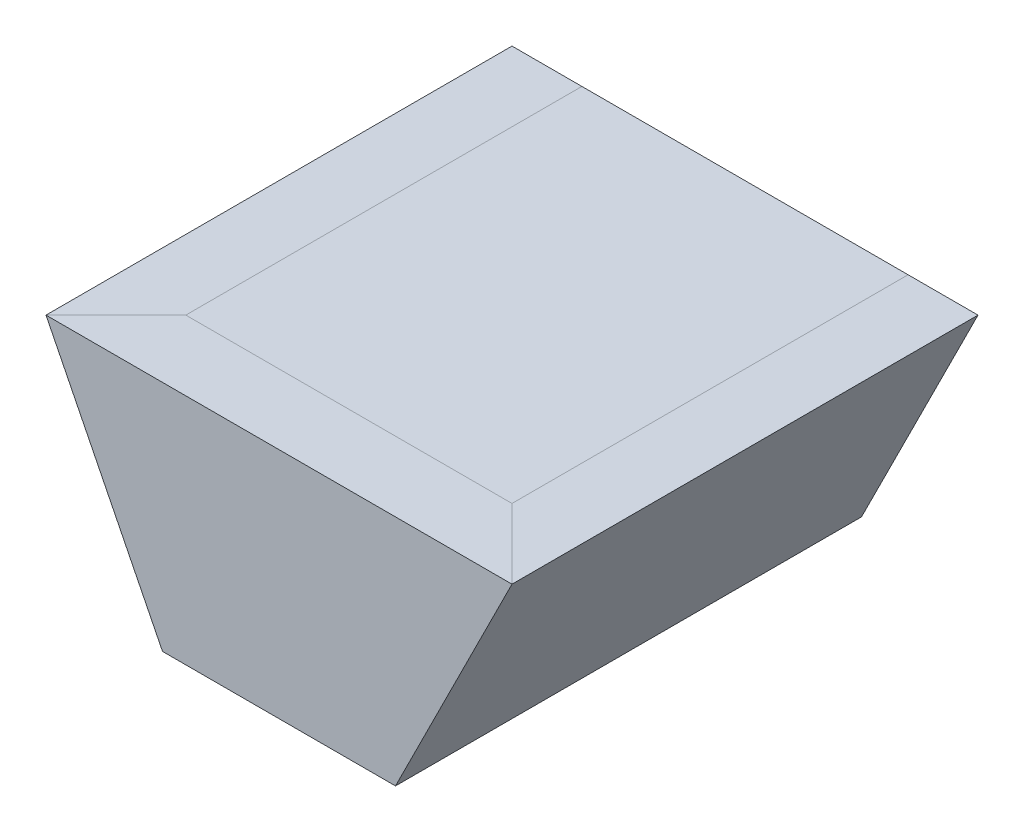
ISO-10303-21;
HEADER;
FILE_DESCRIPTION(('STEP AP214'),'2;1');
FILE_NAME('part.step','',(''),(''),'','','');
FILE_SCHEMA(('AUTOMOTIVE_DESIGN { 1 0 10303 214 1 1 1 1 }'));
ENDSEC;
DATA;
#1=APPLICATION_CONTEXT('core data for automotive mechanical design processes');
#2=APPLICATION_PROTOCOL_DEFINITION('international standard','automotive_design',2000,#1);
#3=PRODUCT_CONTEXT('',#1,'mechanical');
#4=PRODUCT('Part','Part','',(#3));
#5=PRODUCT_RELATED_PRODUCT_CATEGORY('part','',(#4));
#6=PRODUCT_DEFINITION_FORMATION('','',#4);
#7=PRODUCT_DEFINITION_CONTEXT('part definition',#1,'design');
#8=PRODUCT_DEFINITION('design','',#6,#7);
#9=PRODUCT_DEFINITION_SHAPE('','',#8);
#10=(LENGTH_UNIT() NAMED_UNIT(*) SI_UNIT(.MILLI.,.METRE.));
#11=(NAMED_UNIT(*) PLANE_ANGLE_UNIT() SI_UNIT($,.RADIAN.));
#12=(NAMED_UNIT(*) SI_UNIT($,.STERADIAN.) SOLID_ANGLE_UNIT());
#13=UNCERTAINTY_MEASURE_WITH_UNIT(LENGTH_MEASURE(1.E-05),#10,'distance_accuracy_value','');
#14=(GEOMETRIC_REPRESENTATION_CONTEXT(3) GLOBAL_UNCERTAINTY_ASSIGNED_CONTEXT((#13)) GLOBAL_UNIT_ASSIGNED_CONTEXT((#10,
#11,#12)) REPRESENTATION_CONTEXT('',''));
#15=CARTESIAN_POINT('',(0.,0.,0.));
#16=DIRECTION('',(0.,0.,1.));
#17=DIRECTION('',(1.,0.,0.));
#18=AXIS2_PLACEMENT_3D('',#15,#16,#17);
#19=CARTESIAN_POINT('',(0.,0.,-200.));
#20=DIRECTION('',(0.,0.,1.));
#21=DIRECTION('',(1.,0.,0.));
#22=AXIS2_PLACEMENT_3D('',#19,#20,#21);
#23=PLANE('',#22);
#24=DIRECTION('',(-0.707106781186548,-0.707106781186548,0.));
#25=VECTOR('',#24,1.);
#26=CARTESIAN_POINT('',(75.,-75.,-200.));
#27=LINE('',#26,#25);
#28=CARTESIAN_POINT('',(70.,-80.,-200.));
#29=VERTEX_POINT('',#28);
#30=CARTESIAN_POINT('',(50.,-100.,-200.));
#31=VERTEX_POINT('',#30);
#32=EDGE_CURVE('E11',#29,#31,#27,.T.);
#33=ORIENTED_EDGE('',*,*,#32,.F.);
#34=DIRECTION('',(1.,0.,0.));
#35=VECTOR('',#34,1.);
#36=CARTESIAN_POINT('',(0.,-80.,-200.));
#37=LINE('',#36,#35);
#38=CARTESIAN_POINT('',(130.,-80.,-200.));
#39=VERTEX_POINT('',#38);
#40=EDGE_CURVE('E158',#29,#39,#37,.T.);
#41=ORIENTED_EDGE('',*,*,#40,.T.);
#42=DIRECTION('',(0.707106781186547,-0.707106781186548,0.));
#43=VECTOR('',#42,1.);
#44=CARTESIAN_POINT('',(25.,25.,-200.));
#45=LINE('',#44,#43);
#46=CARTESIAN_POINT('',(150.,-100.,-200.));
#47=VERTEX_POINT('',#46);
#48=EDGE_CURVE('E44',#39,#47,#45,.T.);
#49=ORIENTED_EDGE('',*,*,#48,.T.);
#50=DIRECTION('',(1.,0.,0.));
#51=VECTOR('',#50,1.);
#52=CARTESIAN_POINT('',(50.,-100.,-200.));
#53=LINE('',#52,#51);
#54=EDGE_CURVE('E121',#31,#47,#53,.T.);
#55=ORIENTED_EDGE('',*,*,#54,.F.);
#56=EDGE_LOOP('',(#33,#41,#49,#55));
#57=FACE_BOUND('',#56,.T.);
#58=ADVANCED_FACE('F35',(#57),#23,.F.);
#59=ORIENTED_EDGE('',*,*,#48,.F.);
#60=DIRECTION('',(0.447213595499958,0.894427190999916,0.));
#61=VECTOR('',#60,1.);
#62=CARTESIAN_POINT('',(136.,-68.,-200.));
#63=LINE('',#62,#61);
#64=CARTESIAN_POINT('',(170.,0.,-200.));
#65=VERTEX_POINT('',#64);
#66=EDGE_CURVE('E161',#39,#65,#63,.T.);
#67=ORIENTED_EDGE('',*,*,#66,.T.);
#68=DIRECTION('',(-1.,0.,0.));
#69=VECTOR('',#68,1.);
#70=CARTESIAN_POINT('',(200.,0.,-200.));
#71=LINE('',#70,#69);
#72=CARTESIAN_POINT('',(200.,0.,-200.));
#73=VERTEX_POINT('',#72);
#74=EDGE_CURVE('E108',#73,#65,#71,.T.);
#75=ORIENTED_EDGE('',*,*,#74,.F.);
#76=DIRECTION('',(0.447213595499958,0.894427190999916,0.));
#77=VECTOR('',#76,1.);
#78=CARTESIAN_POINT('',(150.,-100.,-200.));
#79=LINE('',#78,#77);
#80=EDGE_CURVE('E117',#47,#73,#79,.T.);
#81=ORIENTED_EDGE('',*,*,#80,.F.);
#82=EDGE_LOOP('',(#59,#67,#75,#81));
#83=FACE_BOUND('',#82,.T.);
#84=ADVANCED_FACE('F177',(#83),#23,.F.);
#85=CARTESIAN_POINT('',(200.,0.,-200.));
#86=DIRECTION('',(0.,1.,0.));
#87=DIRECTION('',(0.,0.,1.));
#88=AXIS2_PLACEMENT_3D('',#85,#86,#87);
#89=PLANE('',#88);
#90=DIRECTION('',(0.,0.,-1.));
#91=VECTOR('',#90,1.);
#92=CARTESIAN_POINT('',(30.,0.,-200.));
#93=LINE('',#92,#91);
#94=CARTESIAN_POINT('',(30.,0.,-30.));
#95=VERTEX_POINT('',#94);
#96=CARTESIAN_POINT('',(30.,0.,-200.));
#97=VERTEX_POINT('',#96);
#98=EDGE_CURVE('E101',#95,#97,#93,.T.);
#99=ORIENTED_EDGE('',*,*,#98,.F.);
#100=DIRECTION('',(1.,0.,0.));
#101=VECTOR('',#100,1.);
#102=CARTESIAN_POINT('',(200.,0.,-30.));
#103=LINE('',#102,#101);
#104=CARTESIAN_POINT('',(170.,0.,-30.));
#105=VERTEX_POINT('',#104);
#106=EDGE_CURVE('E164',#95,#105,#103,.T.);
#107=ORIENTED_EDGE('',*,*,#106,.T.);
#108=DIRECTION('',(0.,0.,1.));
#109=VECTOR('',#108,1.);
#110=CARTESIAN_POINT('',(170.,0.,-200.));
#111=LINE('',#110,#109);
#112=EDGE_CURVE('E148',#65,#105,#111,.T.);
#113=ORIENTED_EDGE('',*,*,#112,.F.);
#114=EDGE_CURVE('E105',#65,#97,#71,.T.);
#115=ORIENTED_EDGE('',*,*,#114,.T.);
#116=EDGE_LOOP('',(#99,#107,#113,#115));
#117=FACE_BOUND('',#116,.T.);
#118=ADVANCED_FACE('F198',(#117),#89,.T.);
#119=ORIENTED_EDGE('',*,*,#66,.F.);
#120=ORIENTED_EDGE('',*,*,#40,.F.);
#121=DIRECTION('',(0.447213595499958,-0.894427190999916,0.));
#122=VECTOR('',#121,1.);
#123=CARTESIAN_POINT('',(24.,12.,-200.));
#124=LINE('',#123,#122);
#125=EDGE_CURVE('E155',#97,#29,#124,.T.);
#126=ORIENTED_EDGE('',*,*,#125,.F.);
#127=ORIENTED_EDGE('',*,*,#114,.F.);
#128=EDGE_LOOP('',(#119,#120,#126,#127));
#129=FACE_BOUND('',#128,.T.);
#130=ADVANCED_FACE('F192',(#129),#23,.F.);
#131=ORIENTED_EDGE('',*,*,#112,.T.);
#132=DIRECTION('',(0.707106781186548,0.,0.707106781186548));
#133=VECTOR('',#132,1.);
#134=CARTESIAN_POINT('',(100.,0.,-100.));
#135=LINE('',#134,#133);
#136=CARTESIAN_POINT('',(200.,0.,0.));
#137=VERTEX_POINT('',#136);
#138=EDGE_CURVE('E152',#105,#137,#135,.T.);
#139=ORIENTED_EDGE('',*,*,#138,.T.);
#140=DIRECTION('',(0.,0.,1.));
#141=VECTOR('',#140,1.);
#142=CARTESIAN_POINT('',(200.,0.,-200.));
#143=LINE('',#142,#141);
#144=EDGE_CURVE('E137',#73,#137,#143,.T.);
#145=ORIENTED_EDGE('',*,*,#144,.F.);
#146=ORIENTED_EDGE('',*,*,#74,.T.);
#147=EDGE_LOOP('',(#131,#139,#145,#146));
#148=FACE_BOUND('',#147,.T.);
#149=ADVANCED_FACE('F180',(#148),#89,.T.);
#150=DIRECTION('',(0.,0.,1.));
#151=VECTOR('',#150,1.);
#152=CARTESIAN_POINT('',(0.,0.,-200.));
#153=LINE('',#152,#151);
#154=CARTESIAN_POINT('',(0.,0.,-200.));
#155=VERTEX_POINT('',#154);
#156=CARTESIAN_POINT('',(0.,0.,0.));
#157=VERTEX_POINT('',#156);
#158=EDGE_CURVE('E98',#155,#157,#153,.T.);
#159=ORIENTED_EDGE('',*,*,#158,.T.);
#160=DIRECTION('',(0.707106781186548,0.,-0.707106781186548));
#161=VECTOR('',#160,1.);
#162=CARTESIAN_POINT('',(200.,0.,-200.));
#163=LINE('',#162,#161);
#164=EDGE_CURVE('E145',#157,#95,#163,.T.);
#165=ORIENTED_EDGE('',*,*,#164,.T.);
#166=ORIENTED_EDGE('',*,*,#98,.T.);
#167=EDGE_CURVE('E94',#97,#155,#71,.T.);
#168=ORIENTED_EDGE('',*,*,#167,.T.);
#169=EDGE_LOOP('',(#159,#165,#166,#168));
#170=FACE_BOUND('',#169,.T.);
#171=ADVANCED_FACE('F96',(#170),#89,.T.);
#172=ORIENTED_EDGE('',*,*,#106,.F.);
#173=ORIENTED_EDGE('',*,*,#164,.F.);
#174=DIRECTION('',(-1.,0.,0.));
#175=VECTOR('',#174,1.);
#176=CARTESIAN_POINT('',(200.,0.,0.));
#177=LINE('',#176,#175);
#178=EDGE_CURVE('E129',#137,#157,#177,.T.);
#179=ORIENTED_EDGE('',*,*,#178,.F.);
#180=ORIENTED_EDGE('',*,*,#138,.F.);
#181=EDGE_LOOP('',(#172,#173,#179,#180));
#182=FACE_BOUND('',#181,.T.);
#183=ADVANCED_FACE('F37',(#182),#89,.T.);
#184=CARTESIAN_POINT('',(150.,-100.,-200.));
#185=DIRECTION('',(0.894427190999916,-0.447213595499958,0.));
#186=DIRECTION('',(0.447213595499958,0.894427190999916,0.));
#187=AXIS2_PLACEMENT_3D('',#184,#185,#186);
#188=PLANE('',#187);
#189=DIRECTION('',(0.447213595499958,0.894427190999916,0.));
#190=VECTOR('',#189,1.);
#191=CARTESIAN_POINT('',(150.,-100.,0.));
#192=LINE('',#191,#190);
#193=CARTESIAN_POINT('',(150.,-100.,0.));
#194=VERTEX_POINT('',#193);
#195=EDGE_CURVE('E106',#194,#137,#192,.T.);
#196=ORIENTED_EDGE('',*,*,#195,.F.);
#197=DIRECTION('',(0.,0.,1.));
#198=VECTOR('',#197,1.);
#199=CARTESIAN_POINT('',(150.,-100.,-200.));
#200=LINE('',#199,#198);
#201=EDGE_CURVE('E140',#47,#194,#200,.T.);
#202=ORIENTED_EDGE('',*,*,#201,.F.);
#203=ORIENTED_EDGE('',*,*,#80,.T.);
#204=ORIENTED_EDGE('',*,*,#144,.T.);
#205=EDGE_LOOP('',(#196,#202,#203,#204));
#206=FACE_BOUND('',#205,.T.);
#207=ADVANCED_FACE('F172',(#206),#188,.T.);
#208=CARTESIAN_POINT('',(50.,-100.,-200.));
#209=DIRECTION('',(0.,-1.,0.));
#210=DIRECTION('',(0.,0.,-1.));
#211=AXIS2_PLACEMENT_3D('',#208,#209,#210);
#212=PLANE('',#211);
#213=DIRECTION('',(1.,0.,0.));
#214=VECTOR('',#213,1.);
#215=CARTESIAN_POINT('',(50.,-100.,0.));
#216=LINE('',#215,#214);
#217=CARTESIAN_POINT('',(50.,-100.,0.));
#218=VERTEX_POINT('',#217);
#219=EDGE_CURVE('E132',#218,#194,#216,.T.);
#220=ORIENTED_EDGE('',*,*,#219,.F.);
#221=DIRECTION('',(0.,0.,1.));
#222=VECTOR('',#221,1.);
#223=CARTESIAN_POINT('',(50.,-100.,-200.));
#224=LINE('',#223,#222);
#225=EDGE_CURVE('E116',#31,#218,#224,.T.);
#226=ORIENTED_EDGE('',*,*,#225,.F.);
#227=ORIENTED_EDGE('',*,*,#54,.T.);
#228=ORIENTED_EDGE('',*,*,#201,.T.);
#229=EDGE_LOOP('',(#220,#226,#227,#228));
#230=FACE_BOUND('',#229,.T.);
#231=ADVANCED_FACE('F175',(#230),#212,.T.);
#232=CARTESIAN_POINT('',(0.,0.,-200.));
#233=DIRECTION('',(-0.894427190999916,-0.447213595499958,0.));
#234=DIRECTION('',(0.447213595499958,-0.894427190999916,0.));
#235=AXIS2_PLACEMENT_3D('',#232,#233,#234);
#236=PLANE('',#235);
#237=DIRECTION('',(0.447213595499958,-0.894427190999916,0.));
#238=VECTOR('',#237,1.);
#239=CARTESIAN_POINT('',(0.,0.,0.));
#240=LINE('',#239,#238);
#241=EDGE_CURVE('E114',#157,#218,#240,.T.);
#242=ORIENTED_EDGE('',*,*,#241,.F.);
#243=ORIENTED_EDGE('',*,*,#158,.F.);
#244=DIRECTION('',(0.447213595499958,-0.894427190999916,0.));
#245=VECTOR('',#244,1.);
#246=CARTESIAN_POINT('',(0.,0.,-200.));
#247=LINE('',#246,#245);
#248=EDGE_CURVE('E112',#155,#31,#247,.T.);
#249=ORIENTED_EDGE('',*,*,#248,.T.);
#250=ORIENTED_EDGE('',*,*,#225,.T.);
#251=EDGE_LOOP('',(#242,#243,#249,#250));
#252=FACE_BOUND('',#251,.T.);
#253=ADVANCED_FACE('F111',(#252),#236,.T.);
#254=ORIENTED_EDGE('',*,*,#125,.T.);
#255=ORIENTED_EDGE('',*,*,#32,.T.);
#256=ORIENTED_EDGE('',*,*,#248,.F.);
#257=ORIENTED_EDGE('',*,*,#167,.F.);
#258=EDGE_LOOP('',(#254,#255,#256,#257));
#259=FACE_BOUND('',#258,.T.);
#260=ADVANCED_FACE('F119',(#259),#23,.F.);
#261=CARTESIAN_POINT('',(0.,0.,0.));
#262=DIRECTION('',(0.,0.,1.));
#263=DIRECTION('',(1.,0.,0.));
#264=AXIS2_PLACEMENT_3D('',#261,#262,#263);
#265=PLANE('',#264);
#266=ORIENTED_EDGE('',*,*,#178,.T.);
#267=ORIENTED_EDGE('',*,*,#241,.T.);
#268=ORIENTED_EDGE('',*,*,#219,.T.);
#269=ORIENTED_EDGE('',*,*,#195,.T.);
#270=EDGE_LOOP('',(#266,#267,#268,#269));
#271=FACE_BOUND('',#270,.T.);
#272=ADVANCED_FACE('F185',(#271),#265,.T.);
#273=CLOSED_SHELL('',(#58,#84,#118,#130,#149,#171,#183,#207,#231,#253,#260,#272));
#274=MANIFOLD_SOLID_BREP('B2',#273);
#275=ADVANCED_BREP_SHAPE_REPRESENTATION('',(#18,#274),#14);
#276=SHAPE_DEFINITION_REPRESENTATION(#9,#275);
ENDSEC;
END-ISO-10303-21;
